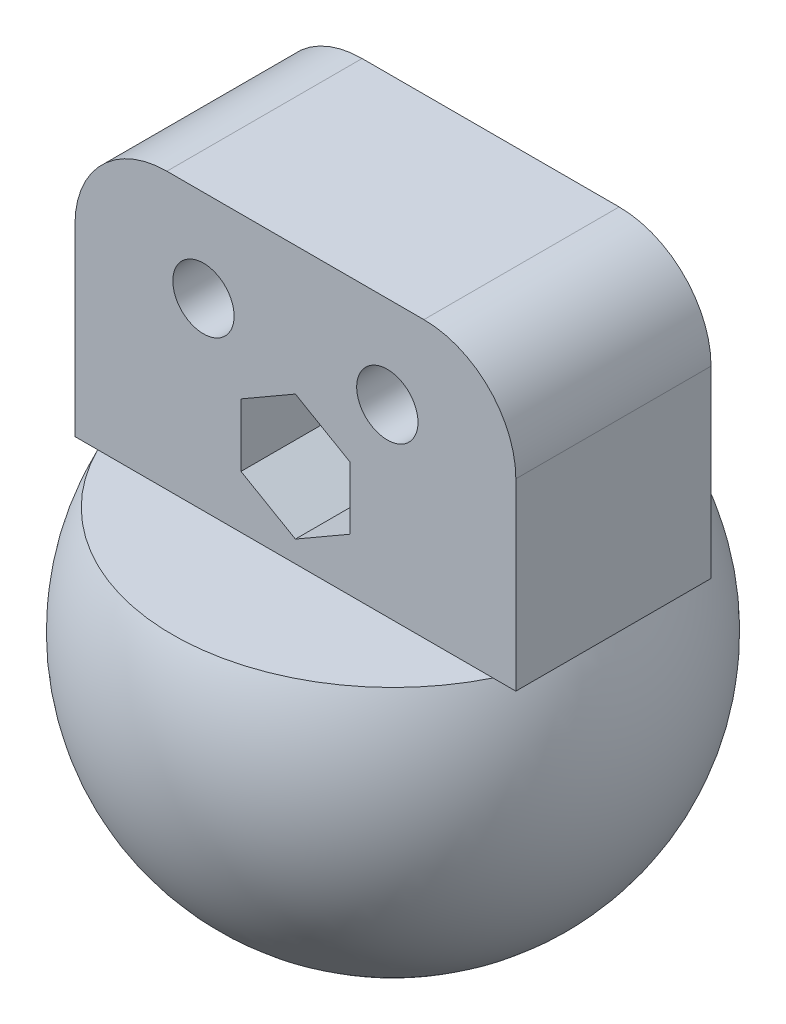
ISO-10303-21;
HEADER;
FILE_DESCRIPTION(('STEP AP214'),'2;1');
FILE_NAME('part.step','',(''),(''),'','','');
FILE_SCHEMA(('AUTOMOTIVE_DESIGN { 1 0 10303 214 1 1 1 1 }'));
ENDSEC;
DATA;
#1=APPLICATION_CONTEXT('core data for automotive mechanical design processes');
#2=APPLICATION_PROTOCOL_DEFINITION('international standard','automotive_design',2000,#1);
#3=PRODUCT_CONTEXT('',#1,'mechanical');
#4=PRODUCT('Part','Part','',(#3));
#5=PRODUCT_RELATED_PRODUCT_CATEGORY('part','',(#4));
#6=PRODUCT_DEFINITION_FORMATION('','',#4);
#7=PRODUCT_DEFINITION_CONTEXT('part definition',#1,'design');
#8=PRODUCT_DEFINITION('design','',#6,#7);
#9=PRODUCT_DEFINITION_SHAPE('','',#8);
#10=(LENGTH_UNIT() NAMED_UNIT(*) SI_UNIT(.MILLI.,.METRE.));
#11=(NAMED_UNIT(*) PLANE_ANGLE_UNIT() SI_UNIT($,.RADIAN.));
#12=(NAMED_UNIT(*) SI_UNIT($,.STERADIAN.) SOLID_ANGLE_UNIT());
#13=UNCERTAINTY_MEASURE_WITH_UNIT(LENGTH_MEASURE(1.E-05),#10,'distance_accuracy_value','');
#14=(GEOMETRIC_REPRESENTATION_CONTEXT(3) GLOBAL_UNCERTAINTY_ASSIGNED_CONTEXT((#13)) GLOBAL_UNIT_ASSIGNED_CONTEXT((#10,
#11,#12)) REPRESENTATION_CONTEXT('',''));
#15=CARTESIAN_POINT('',(0.,0.,0.));
#16=DIRECTION('',(0.,0.,1.));
#17=DIRECTION('',(1.,0.,0.));
#18=AXIS2_PLACEMENT_3D('',#15,#16,#17);
#19=CARTESIAN_POINT('',(0.,0.,0.));
#20=DIRECTION('',(0.,1.,0.));
#21=DIRECTION('',(1.,0.,0.));
#22=AXIS2_PLACEMENT_3D('',#19,#20,#21);
#23=SPHERICAL_SURFACE('',#22,16.);
#24=CARTESIAN_POINT('',(0.,7.,0.));
#25=DIRECTION('',(0.,1.,0.));
#26=DIRECTION('',(0.,0.,1.));
#27=AXIS2_PLACEMENT_3D('',#24,#25,#26);
#28=CIRCLE('',#27,14.3874945699382);
#29=CARTESIAN_POINT('',(-12.9005077419457,7.,-6.37));
#30=VERTEX_POINT('',#29);
#31=CARTESIAN_POINT('',(-14.3874945699382,7.,0.));
#32=VERTEX_POINT('',#31);
#33=EDGE_CURVE('E293',#30,#32,#28,.T.);
#34=ORIENTED_EDGE('',*,*,#33,.F.);
#35=CARTESIAN_POINT('',(0.,7.,0.));
#36=DIRECTION('',(0.,-1.,0.));
#37=DIRECTION('',(0.,0.,-1.));
#38=AXIS2_PLACEMENT_3D('',#35,#36,#37);
#39=CIRCLE('',#38,14.3874945699382);
#40=CARTESIAN_POINT('',(12.9005077419457,7.,-6.37));
#41=VERTEX_POINT('',#40);
#42=EDGE_CURVE('E280',#41,#30,#39,.F.);
#43=ORIENTED_EDGE('',*,*,#42,.F.);
#44=CARTESIAN_POINT('',(14.3874945699382,7.,0.));
#45=VERTEX_POINT('',#44);
#46=EDGE_CURVE('E232',#45,#41,#28,.T.);
#47=ORIENTED_EDGE('',*,*,#46,.F.);
#48=CARTESIAN_POINT('',(12.9005077419457,7.,6.37));
#49=VERTEX_POINT('',#48);
#50=EDGE_CURVE('E235',#49,#45,#28,.T.);
#51=ORIENTED_EDGE('',*,*,#50,.F.);
#52=CARTESIAN_POINT('',(0.,7.,0.));
#53=DIRECTION('',(0.,1.,0.));
#54=DIRECTION('',(0.,0.,1.));
#55=AXIS2_PLACEMENT_3D('',#52,#53,#54);
#56=CIRCLE('',#55,14.3874945699382);
#57=CARTESIAN_POINT('',(-12.9005077419457,7.,6.37));
#58=VERTEX_POINT('',#57);
#59=EDGE_CURVE('E275',#49,#58,#56,.F.);
#60=ORIENTED_EDGE('',*,*,#59,.T.);
#61=EDGE_CURVE('E236',#32,#58,#28,.T.);
#62=ORIENTED_EDGE('',*,*,#61,.F.);
#63=EDGE_LOOP('',(#34,#43,#47,#51,#60,#62));
#64=FACE_BOUND('',#63,.T.);
#65=ADVANCED_FACE('F35',(#64),#23,.T.);
#66=CARTESIAN_POINT('',(-14.3874945699382,7.,6.37));
#67=DIRECTION('',(0.,1.,0.));
#68=DIRECTION('',(0.,0.,1.));
#69=AXIS2_PLACEMENT_3D('',#66,#67,#68);
#70=PLANE('',#69);
#71=DIRECTION('',(1.,0.,0.));
#72=VECTOR('',#71,1.);
#73=CARTESIAN_POINT('',(-14.3874945699382,7.,6.37));
#74=LINE('',#73,#72);
#75=CARTESIAN_POINT('',(14.3874945699382,7.,6.37));
#76=VERTEX_POINT('',#75);
#77=EDGE_CURVE('E205',#49,#76,#74,.T.);
#78=ORIENTED_EDGE('',*,*,#77,.F.);
#79=ORIENTED_EDGE('',*,*,#50,.T.);
#80=DIRECTION('',(0.,0.,-1.));
#81=VECTOR('',#80,1.);
#82=CARTESIAN_POINT('',(14.3874945699382,7.,6.37));
#83=LINE('',#82,#81);
#84=EDGE_CURVE('E226',#76,#45,#83,.T.);
#85=ORIENTED_EDGE('',*,*,#84,.F.);
#86=EDGE_LOOP('',(#78,#79,#85));
#87=FACE_BOUND('',#86,.T.);
#88=ADVANCED_FACE('F302',(#87),#70,.F.);
#89=CARTESIAN_POINT('',(14.3874945699382,7.,-6.37));
#90=VERTEX_POINT('',#89);
#91=EDGE_CURVE('E216',#45,#90,#83,.T.);
#92=ORIENTED_EDGE('',*,*,#91,.F.);
#93=ORIENTED_EDGE('',*,*,#46,.T.);
#94=DIRECTION('',(1.,0.,0.));
#95=VECTOR('',#94,1.);
#96=CARTESIAN_POINT('',(-14.3874945699382,7.,-6.37));
#97=LINE('',#96,#95);
#98=EDGE_CURVE('E218',#41,#90,#97,.T.);
#99=ORIENTED_EDGE('',*,*,#98,.T.);
#100=EDGE_LOOP('',(#92,#93,#99));
#101=FACE_BOUND('',#100,.T.);
#102=ADVANCED_FACE('F307',(#101),#70,.F.);
#103=CARTESIAN_POINT('',(-14.3874945699382,7.,-6.37));
#104=VERTEX_POINT('',#103);
#105=EDGE_CURVE('E219',#104,#30,#97,.T.);
#106=ORIENTED_EDGE('',*,*,#105,.T.);
#107=ORIENTED_EDGE('',*,*,#33,.T.);
#108=DIRECTION('',(0.,0.,-1.));
#109=VECTOR('',#108,1.);
#110=CARTESIAN_POINT('',(-14.3874945699382,7.,6.37));
#111=LINE('',#110,#109);
#112=EDGE_CURVE('E229',#32,#104,#111,.T.);
#113=ORIENTED_EDGE('',*,*,#112,.T.);
#114=EDGE_LOOP('',(#106,#107,#113));
#115=FACE_BOUND('',#114,.T.);
#116=ADVANCED_FACE('F353',(#115),#70,.F.);
#117=CARTESIAN_POINT('',(-3.55,14.5495934556232,6.37));
#118=DIRECTION('',(1.,0.,0.));
#119=DIRECTION('',(0.,1.,0.));
#120=AXIS2_PLACEMENT_3D('',#117,#118,#119);
#121=PLANE('',#120);
#122=DIRECTION('',(0.,-1.,0.));
#123=VECTOR('',#122,1.);
#124=CARTESIAN_POINT('',(-3.55,14.5495934556232,6.37));
#125=LINE('',#124,#123);
#126=CARTESIAN_POINT('',(-3.55,14.5495934556232,6.37));
#127=VERTEX_POINT('',#126);
#128=CARTESIAN_POINT('',(-3.55,10.4504065443768,6.37));
#129=VERTEX_POINT('',#128);
#130=EDGE_CURVE('E148',#127,#129,#125,.T.);
#131=ORIENTED_EDGE('',*,*,#130,.T.);
#132=DIRECTION('',(0.,0.,1.));
#133=VECTOR('',#132,1.);
#134=CARTESIAN_POINT('',(-3.55,10.4504065443768,-16.));
#135=LINE('',#134,#133);
#136=CARTESIAN_POINT('',(-3.55,10.4504065443768,-6.37));
#137=VERTEX_POINT('',#136);
#138=EDGE_CURVE('E153',#137,#129,#135,.T.);
#139=ORIENTED_EDGE('',*,*,#138,.F.);
#140=DIRECTION('',(0.,-1.,0.));
#141=VECTOR('',#140,1.);
#142=CARTESIAN_POINT('',(-3.55,14.5495934556232,-6.37));
#143=LINE('',#142,#141);
#144=CARTESIAN_POINT('',(-3.55,14.5495934556232,-6.37));
#145=VERTEX_POINT('',#144);
#146=EDGE_CURVE('E179',#145,#137,#143,.T.);
#147=ORIENTED_EDGE('',*,*,#146,.F.);
#148=DIRECTION('',(0.,0.,-1.));
#149=VECTOR('',#148,1.);
#150=CARTESIAN_POINT('',(-3.55,14.5495934556232,6.37));
#151=LINE('',#150,#149);
#152=EDGE_CURVE('E162',#127,#145,#151,.T.);
#153=ORIENTED_EDGE('',*,*,#152,.F.);
#154=EDGE_LOOP('',(#131,#139,#147,#153));
#155=FACE_BOUND('',#154,.T.);
#156=ADVANCED_FACE('F160',(#155),#121,.T.);
#157=CARTESIAN_POINT('',(3.55,10.4504065443768,6.37));
#158=DIRECTION('',(-1.,0.,0.));
#159=DIRECTION('',(0.,-1.,0.));
#160=AXIS2_PLACEMENT_3D('',#157,#158,#159);
#161=PLANE('',#160);
#162=DIRECTION('',(0.,0.,-1.));
#163=VECTOR('',#162,1.);
#164=CARTESIAN_POINT('',(3.55,14.5495934556232,6.37));
#165=LINE('',#164,#163);
#166=CARTESIAN_POINT('',(3.55,14.5495934556232,6.37));
#167=VERTEX_POINT('',#166);
#168=CARTESIAN_POINT('',(3.55,14.5495934556232,-6.37));
#169=VERTEX_POINT('',#168);
#170=EDGE_CURVE('E167',#167,#169,#165,.T.);
#171=ORIENTED_EDGE('',*,*,#170,.T.);
#172=DIRECTION('',(0.,1.,0.));
#173=VECTOR('',#172,1.);
#174=CARTESIAN_POINT('',(3.55,10.4504065443768,-6.37));
#175=LINE('',#174,#173);
#176=CARTESIAN_POINT('',(3.55,10.4504065443768,-6.37));
#177=VERTEX_POINT('',#176);
#178=EDGE_CURVE('E181',#177,#169,#175,.T.);
#179=ORIENTED_EDGE('',*,*,#178,.F.);
#180=DIRECTION('',(0.,0.,1.));
#181=VECTOR('',#180,1.);
#182=CARTESIAN_POINT('',(3.55,10.4504065443768,-16.));
#183=LINE('',#182,#181);
#184=CARTESIAN_POINT('',(3.55,10.4504065443768,6.37));
#185=VERTEX_POINT('',#184);
#186=EDGE_CURVE('E150',#177,#185,#183,.T.);
#187=ORIENTED_EDGE('',*,*,#186,.T.);
#188=DIRECTION('',(0.,1.,0.));
#189=VECTOR('',#188,1.);
#190=CARTESIAN_POINT('',(3.55,10.4504065443768,6.37));
#191=LINE('',#190,#189);
#192=EDGE_CURVE('E163',#185,#167,#191,.T.);
#193=ORIENTED_EDGE('',*,*,#192,.T.);
#194=EDGE_LOOP('',(#171,#179,#187,#193));
#195=FACE_BOUND('',#194,.T.);
#196=ADVANCED_FACE('F265',(#195),#161,.T.);
#197=CARTESIAN_POINT('',(0.,0.,6.37));
#198=DIRECTION('',(0.,0.,1.));
#199=DIRECTION('',(1.,0.,0.));
#200=AXIS2_PLACEMENT_3D('',#197,#198,#199);
#201=PLANE('',#200);
#202=ORIENTED_EDGE('',*,*,#192,.F.);
#203=DIRECTION('',(0.866025403784438,0.5,0.));
#204=VECTOR('',#203,1.);
#205=CARTESIAN_POINT('',(-3.63765877365274,6.30060981656524,6.37));
#206=LINE('',#205,#204);
#207=CARTESIAN_POINT('',(0.,8.40081308875366,6.37));
#208=VERTEX_POINT('',#207);
#209=EDGE_CURVE('E149',#208,#185,#206,.T.);
#210=ORIENTED_EDGE('',*,*,#209,.F.);
#211=DIRECTION('',(0.866025403784439,-0.5,0.));
#212=VECTOR('',#211,1.);
#213=CARTESIAN_POINT('',(3.63765877365274,6.30060981656524,6.37));
#214=LINE('',#213,#212);
#215=EDGE_CURVE('E142',#129,#208,#214,.T.);
#216=ORIENTED_EDGE('',*,*,#215,.F.);
#217=ORIENTED_EDGE('',*,*,#130,.F.);
#218=DIRECTION('',(-0.866025403784438,-0.5,0.));
#219=VECTOR('',#218,1.);
#220=CARTESIAN_POINT('',(0.,16.5991869112463,6.37));
#221=LINE('',#220,#219);
#222=CARTESIAN_POINT('',(0.,16.5991869112463,6.37));
#223=VERTEX_POINT('',#222);
#224=EDGE_CURVE('E164',#223,#127,#221,.T.);
#225=ORIENTED_EDGE('',*,*,#224,.F.);
#226=DIRECTION('',(-0.866025403784439,0.5,0.));
#227=VECTOR('',#226,1.);
#228=CARTESIAN_POINT('',(3.55,14.5495934556232,6.37));
#229=LINE('',#228,#227);
#230=EDGE_CURVE('E169',#167,#223,#229,.T.);
#231=ORIENTED_EDGE('',*,*,#230,.F.);
#232=EDGE_LOOP('',(#202,#210,#216,#217,#225,#231));
#233=FACE_BOUND('',#232,.T.);
#234=DIRECTION('',(-1.,0.,0.));
#235=VECTOR('',#234,1.);
#236=CARTESIAN_POINT('',(-14.3874945699382,25.,6.37));
#237=LINE('',#236,#235);
#238=CARTESIAN_POINT('',(8.38749456993816,25.,6.37));
#239=VERTEX_POINT('',#238);
#240=CARTESIAN_POINT('',(-8.38749456993816,25.,6.37));
#241=VERTEX_POINT('',#240);
#242=EDGE_CURVE('E213',#239,#241,#237,.T.);
#243=ORIENTED_EDGE('',*,*,#242,.T.);
#244=CARTESIAN_POINT('',(-8.38749456993816,19.,6.37));
#245=DIRECTION('',(0.,0.,1.));
#246=DIRECTION('',(1.,0.,0.));
#247=AXIS2_PLACEMENT_3D('',#244,#245,#246);
#248=CIRCLE('',#247,6.);
#249=CARTESIAN_POINT('',(-14.3874945699382,19.,6.37));
#250=VERTEX_POINT('',#249);
#251=EDGE_CURVE('E252',#241,#250,#248,.T.);
#252=ORIENTED_EDGE('',*,*,#251,.T.);
#253=DIRECTION('',(0.,-1.,0.));
#254=VECTOR('',#253,1.);
#255=CARTESIAN_POINT('',(-14.3874945699382,25.,6.37));
#256=LINE('',#255,#254);
#257=CARTESIAN_POINT('',(-14.3874945699382,7.,6.37));
#258=VERTEX_POINT('',#257);
#259=EDGE_CURVE('E202',#250,#258,#256,.T.);
#260=ORIENTED_EDGE('',*,*,#259,.T.);
#261=EDGE_CURVE('E207',#258,#58,#74,.T.);
#262=ORIENTED_EDGE('',*,*,#261,.T.);
#263=DIRECTION('',(1.,0.,0.));
#264=VECTOR('',#263,1.);
#265=CARTESIAN_POINT('',(-14.3874945699382,7.,6.37));
#266=LINE('',#265,#264);
#267=EDGE_CURVE('E177',#58,#49,#266,.T.);
#268=ORIENTED_EDGE('',*,*,#267,.T.);
#269=ORIENTED_EDGE('',*,*,#77,.T.);
#270=DIRECTION('',(0.,1.,0.));
#271=VECTOR('',#270,1.);
#272=CARTESIAN_POINT('',(14.3874945699382,25.,6.37));
#273=LINE('',#272,#271);
#274=CARTESIAN_POINT('',(14.3874945699382,19.,6.37));
#275=VERTEX_POINT('',#274);
#276=EDGE_CURVE('E210',#76,#275,#273,.T.);
#277=ORIENTED_EDGE('',*,*,#276,.T.);
#278=CARTESIAN_POINT('',(8.38749456993816,19.,6.37));
#279=DIRECTION('',(0.,0.,1.));
#280=DIRECTION('',(1.,0.,0.));
#281=AXIS2_PLACEMENT_3D('',#278,#279,#280);
#282=CIRCLE('',#281,6.);
#283=EDGE_CURVE('E249',#275,#239,#282,.T.);
#284=ORIENTED_EDGE('',*,*,#283,.T.);
#285=EDGE_LOOP('',(#243,#252,#260,#262,#268,#269,#277,#284));
#286=FACE_BOUND('',#285,.T.);
#287=CARTESIAN_POINT('',(6.,19.,6.37));
#288=DIRECTION('',(0.,0.,1.));
#289=DIRECTION('',(1.,0.,0.));
#290=AXIS2_PLACEMENT_3D('',#287,#288,#289);
#291=CIRCLE('',#290,2.);
#292=CARTESIAN_POINT('',(8.,19.,6.37));
#293=VERTEX_POINT('',#292);
#294=EDGE_CURVE('E196',#293,#293,#291,.T.);
#295=ORIENTED_EDGE('',*,*,#294,.F.);
#296=EDGE_LOOP('',(#295));
#297=FACE_BOUND('',#296,.T.);
#298=CARTESIAN_POINT('',(-6.,19.,6.37));
#299=DIRECTION('',(0.,0.,1.));
#300=DIRECTION('',(1.,0.,0.));
#301=AXIS2_PLACEMENT_3D('',#298,#299,#300);
#302=CIRCLE('',#301,2.);
#303=CARTESIAN_POINT('',(-4.,19.,6.37));
#304=VERTEX_POINT('',#303);
#305=EDGE_CURVE('E190',#304,#304,#302,.T.);
#306=ORIENTED_EDGE('',*,*,#305,.F.);
#307=EDGE_LOOP('',(#306));
#308=FACE_BOUND('',#307,.T.);
#309=ADVANCED_FACE('F144',(#233,#286,#297,#308),#201,.T.);
#310=CARTESIAN_POINT('',(0.,0.,-6.37));
#311=DIRECTION('',(0.,0.,1.));
#312=DIRECTION('',(1.,0.,0.));
#313=AXIS2_PLACEMENT_3D('',#310,#311,#312);
#314=PLANE('',#313);
#315=DIRECTION('',(0.,-1.,0.));
#316=VECTOR('',#315,1.);
#317=CARTESIAN_POINT('',(-14.3874945699382,25.,-6.37));
#318=LINE('',#317,#316);
#319=CARTESIAN_POINT('',(-14.3874945699382,19.,-6.37));
#320=VERTEX_POINT('',#319);
#321=EDGE_CURVE('E199',#320,#104,#318,.T.);
#322=ORIENTED_EDGE('',*,*,#321,.F.);
#323=CARTESIAN_POINT('',(-8.38749456993816,19.,-6.37));
#324=DIRECTION('',(0.,0.,1.));
#325=DIRECTION('',(1.,0.,0.));
#326=AXIS2_PLACEMENT_3D('',#323,#324,#325);
#327=CIRCLE('',#326,6.);
#328=CARTESIAN_POINT('',(-8.38749456993816,25.,-6.37));
#329=VERTEX_POINT('',#328);
#330=EDGE_CURVE('E242',#320,#329,#327,.F.);
#331=ORIENTED_EDGE('',*,*,#330,.T.);
#332=DIRECTION('',(-1.,0.,0.));
#333=VECTOR('',#332,1.);
#334=CARTESIAN_POINT('',(-14.3874945699382,25.,-6.37));
#335=LINE('',#334,#333);
#336=CARTESIAN_POINT('',(8.38749456993816,25.,-6.37));
#337=VERTEX_POINT('',#336);
#338=EDGE_CURVE('E206',#337,#329,#335,.T.);
#339=ORIENTED_EDGE('',*,*,#338,.F.);
#340=CARTESIAN_POINT('',(8.38749456993816,19.,-6.37));
#341=DIRECTION('',(0.,0.,1.));
#342=DIRECTION('',(1.,0.,0.));
#343=AXIS2_PLACEMENT_3D('',#340,#341,#342);
#344=CIRCLE('',#343,6.);
#345=CARTESIAN_POINT('',(14.3874945699382,19.,-6.37));
#346=VERTEX_POINT('',#345);
#347=EDGE_CURVE('E239',#337,#346,#344,.F.);
#348=ORIENTED_EDGE('',*,*,#347,.T.);
#349=DIRECTION('',(0.,1.,0.));
#350=VECTOR('',#349,1.);
#351=CARTESIAN_POINT('',(14.3874945699382,25.,-6.37));
#352=LINE('',#351,#350);
#353=EDGE_CURVE('E222',#90,#346,#352,.T.);
#354=ORIENTED_EDGE('',*,*,#353,.F.);
#355=ORIENTED_EDGE('',*,*,#98,.F.);
#356=DIRECTION('',(1.,0.,0.));
#357=VECTOR('',#356,1.);
#358=CARTESIAN_POINT('',(0.,7.,-6.37));
#359=LINE('',#358,#357);
#360=EDGE_CURVE('E278',#30,#41,#359,.T.);
#361=ORIENTED_EDGE('',*,*,#360,.F.);
#362=ORIENTED_EDGE('',*,*,#105,.F.);
#363=EDGE_LOOP('',(#322,#331,#339,#348,#354,#355,#361,#362));
#364=FACE_BOUND('',#363,.T.);
#365=CARTESIAN_POINT('',(-6.,19.,-6.37));
#366=DIRECTION('',(0.,0.,1.));
#367=DIRECTION('',(1.,0.,0.));
#368=AXIS2_PLACEMENT_3D('',#365,#366,#367);
#369=CIRCLE('',#368,2.);
#370=CARTESIAN_POINT('',(-4.,19.,-6.37));
#371=VERTEX_POINT('',#370);
#372=EDGE_CURVE('E189',#371,#371,#369,.T.);
#373=ORIENTED_EDGE('',*,*,#372,.T.);
#374=EDGE_LOOP('',(#373));
#375=FACE_BOUND('',#374,.T.);
#376=CARTESIAN_POINT('',(6.,19.,-6.37));
#377=DIRECTION('',(0.,0.,1.));
#378=DIRECTION('',(1.,0.,0.));
#379=AXIS2_PLACEMENT_3D('',#376,#377,#378);
#380=CIRCLE('',#379,2.);
#381=CARTESIAN_POINT('',(8.,19.,-6.37));
#382=VERTEX_POINT('',#381);
#383=EDGE_CURVE('E193',#382,#382,#380,.T.);
#384=ORIENTED_EDGE('',*,*,#383,.T.);
#385=EDGE_LOOP('',(#384));
#386=FACE_BOUND('',#385,.T.);
#387=DIRECTION('',(0.866025403784438,0.5,0.));
#388=VECTOR('',#387,1.);
#389=CARTESIAN_POINT('',(-3.63765877365274,6.30060981656524,-6.37));
#390=LINE('',#389,#388);
#391=CARTESIAN_POINT('',(0.,8.40081308875366,-6.37));
#392=VERTEX_POINT('',#391);
#393=EDGE_CURVE('E11',#392,#177,#390,.T.);
#394=ORIENTED_EDGE('',*,*,#393,.T.);
#395=ORIENTED_EDGE('',*,*,#178,.T.);
#396=DIRECTION('',(-0.866025403784439,0.5,0.));
#397=VECTOR('',#396,1.);
#398=CARTESIAN_POINT('',(3.55,14.5495934556232,-6.37));
#399=LINE('',#398,#397);
#400=CARTESIAN_POINT('',(0.,16.5991869112463,-6.37));
#401=VERTEX_POINT('',#400);
#402=EDGE_CURVE('E173',#169,#401,#399,.T.);
#403=ORIENTED_EDGE('',*,*,#402,.T.);
#404=DIRECTION('',(-0.866025403784438,-0.5,0.));
#405=VECTOR('',#404,1.);
#406=CARTESIAN_POINT('',(0.,16.5991869112463,-6.37));
#407=LINE('',#406,#405);
#408=EDGE_CURVE('E176',#401,#145,#407,.T.);
#409=ORIENTED_EDGE('',*,*,#408,.T.);
#410=ORIENTED_EDGE('',*,*,#146,.T.);
#411=DIRECTION('',(0.866025403784439,-0.5,0.));
#412=VECTOR('',#411,1.);
#413=CARTESIAN_POINT('',(3.63765877365274,6.30060981656524,-6.37));
#414=LINE('',#413,#412);
#415=EDGE_CURVE('E43',#137,#392,#414,.T.);
#416=ORIENTED_EDGE('',*,*,#415,.T.);
#417=EDGE_LOOP('',(#394,#395,#403,#409,#410,#416));
#418=FACE_BOUND('',#417,.T.);
#419=ADVANCED_FACE('F257',(#364,#375,#386,#418),#314,.F.);
#420=CARTESIAN_POINT('',(-14.3874945699382,25.,6.37));
#421=DIRECTION('',(1.,0.,0.));
#422=DIRECTION('',(0.,1.,0.));
#423=AXIS2_PLACEMENT_3D('',#420,#421,#422);
#424=PLANE('',#423);
#425=ORIENTED_EDGE('',*,*,#259,.F.);
#426=DIRECTION('',(0.,0.,-1.));
#427=VECTOR('',#426,1.);
#428=CARTESIAN_POINT('',(-14.3874945699382,19.,6.37));
#429=LINE('',#428,#427);
#430=EDGE_CURVE('E237',#250,#320,#429,.T.);
#431=ORIENTED_EDGE('',*,*,#430,.T.);
#432=ORIENTED_EDGE('',*,*,#321,.T.);
#433=ORIENTED_EDGE('',*,*,#112,.F.);
#434=EDGE_CURVE('E230',#258,#32,#111,.T.);
#435=ORIENTED_EDGE('',*,*,#434,.F.);
#436=EDGE_LOOP('',(#425,#431,#432,#433,#435));
#437=FACE_BOUND('',#436,.T.);
#438=ADVANCED_FACE('F333',(#437),#424,.F.);
#439=ORIENTED_EDGE('',*,*,#434,.T.);
#440=ORIENTED_EDGE('',*,*,#61,.T.);
#441=ORIENTED_EDGE('',*,*,#261,.F.);
#442=EDGE_LOOP('',(#439,#440,#441));
#443=FACE_BOUND('',#442,.T.);
#444=ADVANCED_FACE('F331',(#443),#70,.F.);
#445=CARTESIAN_POINT('',(14.3874945699382,25.,6.37));
#446=DIRECTION('',(-1.,0.,0.));
#447=DIRECTION('',(0.,-1.,0.));
#448=AXIS2_PLACEMENT_3D('',#445,#446,#447);
#449=PLANE('',#448);
#450=ORIENTED_EDGE('',*,*,#353,.T.);
#451=DIRECTION('',(0.,0.,-1.));
#452=VECTOR('',#451,1.);
#453=CARTESIAN_POINT('',(14.3874945699382,19.,6.37));
#454=LINE('',#453,#452);
#455=EDGE_CURVE('E57',#346,#275,#454,.F.);
#456=ORIENTED_EDGE('',*,*,#455,.T.);
#457=ORIENTED_EDGE('',*,*,#276,.F.);
#458=ORIENTED_EDGE('',*,*,#84,.T.);
#459=ORIENTED_EDGE('',*,*,#91,.T.);
#460=EDGE_LOOP('',(#450,#456,#457,#458,#459));
#461=FACE_BOUND('',#460,.T.);
#462=ADVANCED_FACE('F309',(#461),#449,.F.);
#463=CARTESIAN_POINT('',(-14.3874945699382,25.,6.37));
#464=DIRECTION('',(0.,-1.,0.));
#465=DIRECTION('',(0.,0.,-1.));
#466=AXIS2_PLACEMENT_3D('',#463,#464,#465);
#467=PLANE('',#466);
#468=ORIENTED_EDGE('',*,*,#338,.T.);
#469=DIRECTION('',(0.,0.,-1.));
#470=VECTOR('',#469,1.);
#471=CARTESIAN_POINT('',(-8.38749456993816,25.,6.37));
#472=LINE('',#471,#470);
#473=EDGE_CURVE('E247',#329,#241,#472,.F.);
#474=ORIENTED_EDGE('',*,*,#473,.T.);
#475=ORIENTED_EDGE('',*,*,#242,.F.);
#476=DIRECTION('',(0.,0.,-1.));
#477=VECTOR('',#476,1.);
#478=CARTESIAN_POINT('',(8.38749456993816,25.,6.37));
#479=LINE('',#478,#477);
#480=EDGE_CURVE('E245',#239,#337,#479,.T.);
#481=ORIENTED_EDGE('',*,*,#480,.T.);
#482=EDGE_LOOP('',(#468,#474,#475,#481));
#483=FACE_BOUND('',#482,.T.);
#484=ADVANCED_FACE('F344',(#483),#467,.F.);
#485=CARTESIAN_POINT('',(6.,19.,6.37));
#486=DIRECTION('',(0.,0.,-1.));
#487=DIRECTION('',(-1.,0.,0.));
#488=AXIS2_PLACEMENT_3D('',#485,#486,#487);
#489=CYLINDRICAL_SURFACE('',#488,2.);
#490=ORIENTED_EDGE('',*,*,#294,.T.);
#491=EDGE_LOOP('',(#490));
#492=FACE_BOUND('',#491,.T.);
#493=ORIENTED_EDGE('',*,*,#383,.F.);
#494=EDGE_LOOP('',(#493));
#495=FACE_BOUND('',#494,.T.);
#496=ADVANCED_FACE('F378',(#492,#495),#489,.F.);
#497=CARTESIAN_POINT('',(-6.,19.,6.37));
#498=DIRECTION('',(0.,0.,-1.));
#499=DIRECTION('',(-1.,0.,0.));
#500=AXIS2_PLACEMENT_3D('',#497,#498,#499);
#501=CYLINDRICAL_SURFACE('',#500,2.);
#502=ORIENTED_EDGE('',*,*,#305,.T.);
#503=EDGE_LOOP('',(#502));
#504=FACE_BOUND('',#503,.T.);
#505=ORIENTED_EDGE('',*,*,#372,.F.);
#506=EDGE_LOOP('',(#505));
#507=FACE_BOUND('',#506,.T.);
#508=ADVANCED_FACE('F382',(#504,#507),#501,.F.);
#509=CARTESIAN_POINT('',(3.55,14.5495934556232,6.37));
#510=DIRECTION('',(-0.5,-0.866025403784439,0.));
#511=DIRECTION('',(0.866025403784439,-0.5,0.));
#512=AXIS2_PLACEMENT_3D('',#509,#510,#511);
#513=PLANE('',#512);
#514=ORIENTED_EDGE('',*,*,#402,.F.);
#515=ORIENTED_EDGE('',*,*,#170,.F.);
#516=ORIENTED_EDGE('',*,*,#230,.T.);
#517=DIRECTION('',(0.,0.,-1.));
#518=VECTOR('',#517,1.);
#519=CARTESIAN_POINT('',(0.,16.5991869112463,6.37));
#520=LINE('',#519,#518);
#521=EDGE_CURVE('E187',#223,#401,#520,.T.);
#522=ORIENTED_EDGE('',*,*,#521,.T.);
#523=EDGE_LOOP('',(#514,#515,#516,#522));
#524=FACE_BOUND('',#523,.T.);
#525=ADVANCED_FACE('F269',(#524),#513,.T.);
#526=CARTESIAN_POINT('',(0.,16.5991869112463,6.37));
#527=DIRECTION('',(0.5,-0.866025403784438,0.));
#528=DIRECTION('',(0.866025403784439,0.5,0.));
#529=AXIS2_PLACEMENT_3D('',#526,#527,#528);
#530=PLANE('',#529);
#531=ORIENTED_EDGE('',*,*,#224,.T.);
#532=ORIENTED_EDGE('',*,*,#152,.T.);
#533=ORIENTED_EDGE('',*,*,#408,.F.);
#534=ORIENTED_EDGE('',*,*,#521,.F.);
#535=EDGE_LOOP('',(#531,#532,#533,#534));
#536=FACE_BOUND('',#535,.T.);
#537=ADVANCED_FACE('F272',(#536),#530,.T.);
#538=CARTESIAN_POINT('',(-14.3874945699382,7.,16.001));
#539=DIRECTION('',(0.,1.,0.));
#540=DIRECTION('',(0.,0.,1.));
#541=AXIS2_PLACEMENT_3D('',#538,#539,#540);
#542=PLANE('',#541);
#543=ORIENTED_EDGE('',*,*,#267,.F.);
#544=ORIENTED_EDGE('',*,*,#59,.F.);
#545=EDGE_LOOP('',(#543,#544));
#546=FACE_BOUND('',#545,.T.);
#547=ADVANCED_FACE('F314',(#546),#542,.T.);
#548=CARTESIAN_POINT('',(0.,7.,-16.001));
#549=DIRECTION('',(0.,-1.,0.));
#550=DIRECTION('',(0.,0.,-1.));
#551=AXIS2_PLACEMENT_3D('',#548,#549,#550);
#552=PLANE('',#551);
#553=ORIENTED_EDGE('',*,*,#42,.T.);
#554=ORIENTED_EDGE('',*,*,#360,.T.);
#555=EDGE_LOOP('',(#553,#554));
#556=FACE_BOUND('',#555,.T.);
#557=ADVANCED_FACE('F287',(#556),#552,.F.);
#558=CARTESIAN_POINT('',(-8.38749456993816,19.,6.37));
#559=DIRECTION('',(0.,0.,-1.));
#560=DIRECTION('',(-1.,0.,0.));
#561=AXIS2_PLACEMENT_3D('',#558,#559,#560);
#562=CYLINDRICAL_SURFACE('',#561,6.);
#563=ORIENTED_EDGE('',*,*,#251,.F.);
#564=ORIENTED_EDGE('',*,*,#473,.F.);
#565=ORIENTED_EDGE('',*,*,#330,.F.);
#566=ORIENTED_EDGE('',*,*,#430,.F.);
#567=EDGE_LOOP('',(#563,#564,#565,#566));
#568=FACE_BOUND('',#567,.T.);
#569=ADVANCED_FACE('F321',(#568),#562,.T.);
#570=CARTESIAN_POINT('',(8.38749456993816,19.,6.37));
#571=DIRECTION('',(0.,0.,-1.));
#572=DIRECTION('',(-1.,0.,0.));
#573=AXIS2_PLACEMENT_3D('',#570,#571,#572);
#574=CYLINDRICAL_SURFACE('',#573,6.);
#575=ORIENTED_EDGE('',*,*,#283,.F.);
#576=ORIENTED_EDGE('',*,*,#455,.F.);
#577=ORIENTED_EDGE('',*,*,#347,.F.);
#578=ORIENTED_EDGE('',*,*,#480,.F.);
#579=EDGE_LOOP('',(#575,#576,#577,#578));
#580=FACE_BOUND('',#579,.T.);
#581=ADVANCED_FACE('F37',(#580),#574,.T.);
#582=CARTESIAN_POINT('',(0.,8.40081308875366,-16.));
#583=DIRECTION('',(0.5,-0.866025403784438,0.));
#584=DIRECTION('',(0.866025403784438,0.5,0.));
#585=AXIS2_PLACEMENT_3D('',#582,#583,#584);
#586=PLANE('',#585);
#587=ORIENTED_EDGE('',*,*,#209,.T.);
#588=ORIENTED_EDGE('',*,*,#186,.F.);
#589=ORIENTED_EDGE('',*,*,#393,.F.);
#590=DIRECTION('',(0.,0.,1.));
#591=VECTOR('',#590,1.);
#592=CARTESIAN_POINT('',(0.,8.40081308875366,-16.));
#593=LINE('',#592,#591);
#594=EDGE_CURVE('E157',#392,#208,#593,.T.);
#595=ORIENTED_EDGE('',*,*,#594,.T.);
#596=EDGE_LOOP('',(#587,#588,#589,#595));
#597=FACE_BOUND('',#596,.T.);
#598=ADVANCED_FACE('F260',(#597),#586,.F.);
#599=CARTESIAN_POINT('',(-3.55,10.4504065443768,-16.));
#600=DIRECTION('',(-0.5,-0.866025403784439,0.));
#601=DIRECTION('',(0.866025403784439,-0.5,0.));
#602=AXIS2_PLACEMENT_3D('',#599,#600,#601);
#603=PLANE('',#602);
#604=ORIENTED_EDGE('',*,*,#215,.T.);
#605=ORIENTED_EDGE('',*,*,#594,.F.);
#606=ORIENTED_EDGE('',*,*,#415,.F.);
#607=ORIENTED_EDGE('',*,*,#138,.T.);
#608=EDGE_LOOP('',(#604,#605,#606,#607));
#609=FACE_BOUND('',#608,.T.);
#610=ADVANCED_FACE('F154',(#609),#603,.F.);
#611=CLOSED_SHELL('',(#65,#88,#102,#116,#156,#196,#309,#419,#438,#444,#462,#484,#496,#508,#525,
#537,#547,#557,#569,#581,#598,#610));
#612=MANIFOLD_SOLID_BREP('B2',#611);
#613=ADVANCED_BREP_SHAPE_REPRESENTATION('',(#18,#612),#14);
#614=SHAPE_DEFINITION_REPRESENTATION(#9,#613);
ENDSEC;
END-ISO-10303-21;
